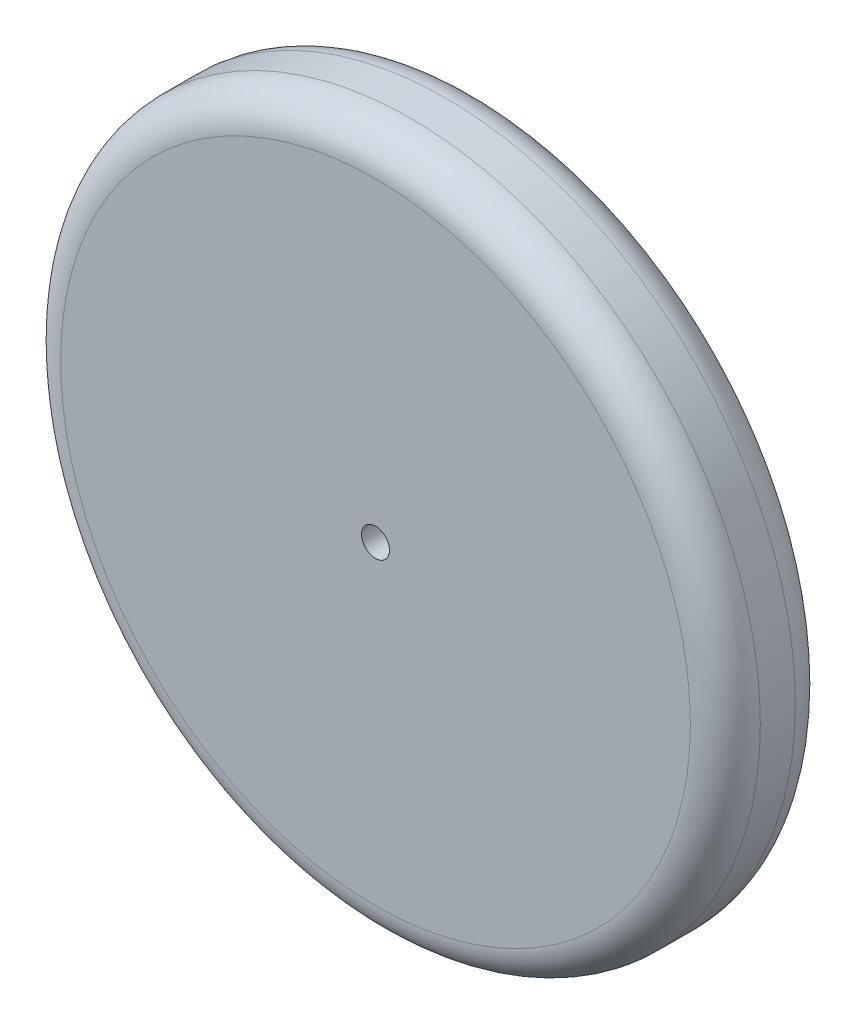
ISO-10303-21;
HEADER;
FILE_DESCRIPTION(('STEP AP214'),'2;1');
FILE_NAME('part.step','',(''),(''),'','','');
FILE_SCHEMA(('AUTOMOTIVE_DESIGN { 1 0 10303 214 1 1 1 1 }'));
ENDSEC;
DATA;
#1=APPLICATION_CONTEXT('core data for automotive mechanical design processes');
#2=APPLICATION_PROTOCOL_DEFINITION('international standard','automotive_design',2000,#1);
#3=PRODUCT_CONTEXT('',#1,'mechanical');
#4=PRODUCT('Part','Part','',(#3));
#5=PRODUCT_RELATED_PRODUCT_CATEGORY('part','',(#4));
#6=PRODUCT_DEFINITION_FORMATION('','',#4);
#7=PRODUCT_DEFINITION_CONTEXT('part definition',#1,'design');
#8=PRODUCT_DEFINITION('design','',#6,#7);
#9=PRODUCT_DEFINITION_SHAPE('','',#8);
#10=(LENGTH_UNIT() NAMED_UNIT(*) SI_UNIT(.MILLI.,.METRE.));
#11=(NAMED_UNIT(*) PLANE_ANGLE_UNIT() SI_UNIT($,.RADIAN.));
#12=(NAMED_UNIT(*) SI_UNIT($,.STERADIAN.) SOLID_ANGLE_UNIT());
#13=UNCERTAINTY_MEASURE_WITH_UNIT(LENGTH_MEASURE(1.E-05),#10,'distance_accuracy_value','');
#14=(GEOMETRIC_REPRESENTATION_CONTEXT(3) GLOBAL_UNCERTAINTY_ASSIGNED_CONTEXT((#13)) GLOBAL_UNIT_ASSIGNED_CONTEXT((#10,
#11,#12)) REPRESENTATION_CONTEXT('',''));
#15=CARTESIAN_POINT('',(0.,0.,0.));
#16=DIRECTION('',(0.,0.,1.));
#17=DIRECTION('',(1.,0.,0.));
#18=AXIS2_PLACEMENT_3D('',#15,#16,#17);
#19=CARTESIAN_POINT('',(0.,0.,30.));
#20=DIRECTION('',(0.,0.,1.));
#21=DIRECTION('',(1.,0.,0.));
#22=AXIS2_PLACEMENT_3D('',#19,#20,#21);
#23=PLANE('',#22);
#24=CARTESIAN_POINT('',(0.,0.,30.));
#25=DIRECTION('',(0.,0.,1.));
#26=DIRECTION('',(1.,0.,0.));
#27=AXIS2_PLACEMENT_3D('',#24,#25,#26);
#28=CIRCLE('',#27,90.);
#29=CARTESIAN_POINT('',(90.,0.,30.));
#30=VERTEX_POINT('',#29);
#31=EDGE_CURVE('E46',#30,#30,#28,.T.);
#32=ORIENTED_EDGE('',*,*,#31,.T.);
#33=EDGE_LOOP('',(#32));
#34=FACE_BOUND('',#33,.T.);
#35=CARTESIAN_POINT('',(0.,0.,30.));
#36=DIRECTION('',(0.,0.,1.));
#37=DIRECTION('',(1.,0.,0.));
#38=AXIS2_PLACEMENT_3D('',#35,#36,#37);
#39=CIRCLE('',#38,4.);
#40=CARTESIAN_POINT('',(4.,0.,30.));
#41=VERTEX_POINT('',#40);
#42=EDGE_CURVE('E51',#41,#41,#39,.T.);
#43=ORIENTED_EDGE('',*,*,#42,.F.);
#44=EDGE_LOOP('',(#43));
#45=FACE_BOUND('',#44,.T.);
#46=ADVANCED_FACE('F31',(#34,#45),#23,.T.);
#47=CARTESIAN_POINT('',(0.,0.,0.));
#48=DIRECTION('',(0.,0.,1.));
#49=DIRECTION('',(1.,0.,0.));
#50=AXIS2_PLACEMENT_3D('',#47,#48,#49);
#51=PLANE('',#50);
#52=CARTESIAN_POINT('',(0.,0.,0.));
#53=DIRECTION('',(0.,0.,1.));
#54=DIRECTION('',(1.,0.,0.));
#55=AXIS2_PLACEMENT_3D('',#52,#53,#54);
#56=CIRCLE('',#55,90.);
#57=CARTESIAN_POINT('',(90.,0.,0.));
#58=VERTEX_POINT('',#57);
#59=EDGE_CURVE('E10',#58,#58,#56,.F.);
#60=ORIENTED_EDGE('',*,*,#59,.T.);
#61=EDGE_LOOP('',(#60));
#62=FACE_BOUND('',#61,.T.);
#63=CARTESIAN_POINT('',(0.,0.,0.));
#64=DIRECTION('',(0.,0.,1.));
#65=DIRECTION('',(1.,0.,0.));
#66=AXIS2_PLACEMENT_3D('',#63,#64,#65);
#67=CIRCLE('',#66,4.);
#68=CARTESIAN_POINT('',(4.,0.,0.));
#69=VERTEX_POINT('',#68);
#70=EDGE_CURVE('E52',#69,#69,#67,.T.);
#71=ORIENTED_EDGE('',*,*,#70,.T.);
#72=EDGE_LOOP('',(#71));
#73=FACE_BOUND('',#72,.T.);
#74=ADVANCED_FACE('F62',(#62,#73),#51,.F.);
#75=CARTESIAN_POINT('',(0.,0.,30.));
#76=DIRECTION('',(0.,0.,-1.));
#77=DIRECTION('',(-1.,0.,0.));
#78=AXIS2_PLACEMENT_3D('',#75,#76,#77);
#79=CYLINDRICAL_SURFACE('',#78,100.);
#80=CARTESIAN_POINT('',(0.,0.,9.99999999999999));
#81=DIRECTION('',(0.,0.,1.));
#82=DIRECTION('',(1.,0.,0.));
#83=AXIS2_PLACEMENT_3D('',#80,#81,#82);
#84=CIRCLE('',#83,100.);
#85=CARTESIAN_POINT('',(100.,0.,9.99999999999999));
#86=VERTEX_POINT('',#85);
#87=EDGE_CURVE('E38',#86,#86,#84,.T.);
#88=ORIENTED_EDGE('',*,*,#87,.T.);
#89=EDGE_LOOP('',(#88));
#90=FACE_BOUND('',#89,.T.);
#91=CARTESIAN_POINT('',(0.,0.,20.));
#92=DIRECTION('',(0.,0.,1.));
#93=DIRECTION('',(1.,0.,0.));
#94=AXIS2_PLACEMENT_3D('',#91,#92,#93);
#95=CIRCLE('',#94,100.);
#96=CARTESIAN_POINT('',(100.,0.,20.));
#97=VERTEX_POINT('',#96);
#98=EDGE_CURVE('E42',#97,#97,#95,.F.);
#99=ORIENTED_EDGE('',*,*,#98,.T.);
#100=EDGE_LOOP('',(#99));
#101=FACE_BOUND('',#100,.T.);
#102=ADVANCED_FACE('F68',(#90,#101),#79,.T.);
#103=CARTESIAN_POINT('',(0.,0.,30.));
#104=DIRECTION('',(0.,0.,-1.));
#105=DIRECTION('',(-1.,0.,0.));
#106=AXIS2_PLACEMENT_3D('',#103,#104,#105);
#107=CYLINDRICAL_SURFACE('',#106,4.);
#108=ORIENTED_EDGE('',*,*,#42,.T.);
#109=EDGE_LOOP('',(#108));
#110=FACE_BOUND('',#109,.T.);
#111=ORIENTED_EDGE('',*,*,#70,.F.);
#112=EDGE_LOOP('',(#111));
#113=FACE_BOUND('',#112,.T.);
#114=ADVANCED_FACE('F58',(#110,#113),#107,.F.);
#115=CARTESIAN_POINT('',(0.,0.,20.));
#116=DIRECTION('',(0.,0.,1.));
#117=DIRECTION('',(1.,0.,0.));
#118=AXIS2_PLACEMENT_3D('',#115,#116,#117);
#119=TOROIDAL_SURFACE('',#118,90.,10.);
#120=ORIENTED_EDGE('',*,*,#98,.F.);
#121=EDGE_LOOP('',(#120));
#122=FACE_BOUND('',#121,.T.);
#123=ORIENTED_EDGE('',*,*,#31,.F.);
#124=EDGE_LOOP('',(#123));
#125=FACE_BOUND('',#124,.T.);
#126=ADVANCED_FACE('F73',(#122,#125),#119,.T.);
#127=CARTESIAN_POINT('',(0.,0.,9.99999999999999));
#128=DIRECTION('',(0.,0.,1.));
#129=DIRECTION('',(1.,0.,0.));
#130=AXIS2_PLACEMENT_3D('',#127,#128,#129);
#131=TOROIDAL_SURFACE('',#130,90.,10.);
#132=ORIENTED_EDGE('',*,*,#59,.F.);
#133=EDGE_LOOP('',(#132));
#134=FACE_BOUND('',#133,.T.);
#135=ORIENTED_EDGE('',*,*,#87,.F.);
#136=EDGE_LOOP('',(#135));
#137=FACE_BOUND('',#136,.T.);
#138=ADVANCED_FACE('F33',(#134,#137),#131,.T.);
#139=CLOSED_SHELL('',(#46,#74,#102,#114,#126,#138));
#140=MANIFOLD_SOLID_BREP('B2',#139);
#141=ADVANCED_BREP_SHAPE_REPRESENTATION('',(#18,#140),#14);
#142=SHAPE_DEFINITION_REPRESENTATION(#9,#141);
ENDSEC;
END-ISO-10303-21;
